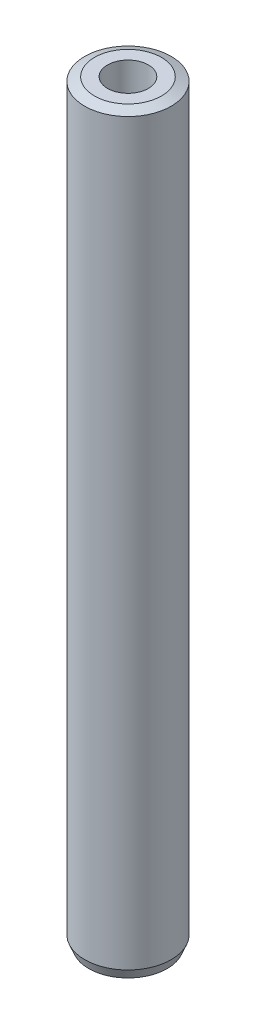
ISO-10303-21;
HEADER;
FILE_DESCRIPTION(('STEP AP214'),'2;1');
FILE_NAME('part.step','',(''),(''),'','','');
FILE_SCHEMA(('AUTOMOTIVE_DESIGN { 1 0 10303 214 1 1 1 1 }'));
ENDSEC;
DATA;
#1=APPLICATION_CONTEXT('core data for automotive mechanical design processes');
#2=APPLICATION_PROTOCOL_DEFINITION('international standard','automotive_design',2000,#1);
#3=PRODUCT_CONTEXT('',#1,'mechanical');
#4=PRODUCT('Part','Part','',(#3));
#5=PRODUCT_RELATED_PRODUCT_CATEGORY('part','',(#4));
#6=PRODUCT_DEFINITION_FORMATION('','',#4);
#7=PRODUCT_DEFINITION_CONTEXT('part definition',#1,'design');
#8=PRODUCT_DEFINITION('design','',#6,#7);
#9=PRODUCT_DEFINITION_SHAPE('','',#8);
#10=(LENGTH_UNIT() NAMED_UNIT(*) SI_UNIT(.MILLI.,.METRE.));
#11=(NAMED_UNIT(*) PLANE_ANGLE_UNIT() SI_UNIT($,.RADIAN.));
#12=(NAMED_UNIT(*) SI_UNIT($,.STERADIAN.) SOLID_ANGLE_UNIT());
#13=UNCERTAINTY_MEASURE_WITH_UNIT(LENGTH_MEASURE(1.E-05),#10,'distance_accuracy_value','');
#14=(GEOMETRIC_REPRESENTATION_CONTEXT(3) GLOBAL_UNCERTAINTY_ASSIGNED_CONTEXT((#13)) GLOBAL_UNIT_ASSIGNED_CONTEXT((#10,
#11,#12)) REPRESENTATION_CONTEXT('',''));
#15=CARTESIAN_POINT('',(0.,0.,0.));
#16=DIRECTION('',(0.,0.,1.));
#17=DIRECTION('',(1.,0.,0.));
#18=AXIS2_PLACEMENT_3D('',#15,#16,#17);
#19=CARTESIAN_POINT('',(0.,217.734931522635,0.));
#20=DIRECTION('',(0.,-1.,0.));
#21=DIRECTION('',(0.,0.,-1.));
#22=AXIS2_PLACEMENT_3D('',#19,#20,#21);
#23=CYLINDRICAL_SURFACE('',#22,12.5);
#24=CARTESIAN_POINT('',(0.,216.581271832505,0.));
#25=DIRECTION('',(0.,1.,0.));
#26=DIRECTION('',(0.,0.,1.));
#27=AXIS2_PLACEMENT_3D('',#24,#25,#26);
#28=CIRCLE('',#27,12.5);
#29=CARTESIAN_POINT('',(0.,216.581271832505,12.5));
#30=VERTEX_POINT('',#29);
#31=EDGE_CURVE('E50',#30,#30,#28,.F.);
#32=ORIENTED_EDGE('',*,*,#31,.T.);
#33=EDGE_LOOP('',(#32));
#34=FACE_BOUND('',#33,.T.);
#35=CARTESIAN_POINT('',(0.,2.81892588250574,0.));
#36=DIRECTION('',(0.,1.,0.));
#37=DIRECTION('',(0.,0.,1.));
#38=AXIS2_PLACEMENT_3D('',#35,#36,#37);
#39=CIRCLE('',#38,12.5);
#40=CARTESIAN_POINT('',(0.,2.81892588250574,12.5));
#41=VERTEX_POINT('',#40);
#42=EDGE_CURVE('E51',#41,#41,#39,.T.);
#43=ORIENTED_EDGE('',*,*,#42,.T.);
#44=EDGE_LOOP('',(#43));
#45=FACE_BOUND('',#44,.T.);
#46=ADVANCED_FACE('F39',(#34,#45),#23,.T.);
#47=CARTESIAN_POINT('',(0.,217.734931522635,0.));
#48=DIRECTION('',(0.,1.,0.));
#49=DIRECTION('',(0.,0.,1.));
#50=AXIS2_PLACEMENT_3D('',#47,#48,#49);
#51=PLANE('',#50);
#52=CARTESIAN_POINT('',(0.,217.734931522635,0.));
#53=DIRECTION('',(0.,1.,0.));
#54=DIRECTION('',(0.,0.,1.));
#55=AXIS2_PLACEMENT_3D('',#52,#53,#54);
#56=CIRCLE('',#55,9.68107411749422);
#57=CARTESIAN_POINT('',(0.,217.734931522635,9.68107411749422));
#58=VERTEX_POINT('',#57);
#59=EDGE_CURVE('E54',#58,#58,#56,.T.);
#60=ORIENTED_EDGE('',*,*,#59,.T.);
#61=EDGE_LOOP('',(#60));
#62=FACE_BOUND('',#61,.T.);
#63=CARTESIAN_POINT('',(0.,217.734931522635,0.));
#64=DIRECTION('',(0.,1.,0.));
#65=DIRECTION('',(0.,0.,1.));
#66=AXIS2_PLACEMENT_3D('',#63,#64,#65);
#67=CIRCLE('',#66,5.90365599291404);
#68=CARTESIAN_POINT('',(0.,217.734931522635,5.90365599291404));
#69=VERTEX_POINT('',#68);
#70=EDGE_CURVE('E58',#69,#69,#67,.T.);
#71=ORIENTED_EDGE('',*,*,#70,.F.);
#72=EDGE_LOOP('',(#71));
#73=FACE_BOUND('',#72,.T.);
#74=ADVANCED_FACE('F69',(#62,#73),#51,.T.);
#75=CARTESIAN_POINT('',(0.,0.,0.));
#76=DIRECTION('',(0.,1.,0.));
#77=DIRECTION('',(0.,0.,1.));
#78=AXIS2_PLACEMENT_3D('',#75,#76,#77);
#79=PLANE('',#78);
#80=CARTESIAN_POINT('',(0.,0.,0.));
#81=DIRECTION('',(0.,1.,0.));
#82=DIRECTION('',(0.,0.,1.));
#83=AXIS2_PLACEMENT_3D('',#80,#81,#82);
#84=CIRCLE('',#83,11.3463403098697);
#85=CARTESIAN_POINT('',(0.,0.,11.3463403098697));
#86=VERTEX_POINT('',#85);
#87=EDGE_CURVE('E10',#86,#86,#84,.F.);
#88=ORIENTED_EDGE('',*,*,#87,.T.);
#89=EDGE_LOOP('',(#88));
#90=FACE_BOUND('',#89,.T.);
#91=CARTESIAN_POINT('',(0.,0.,0.));
#92=DIRECTION('',(0.,1.,0.));
#93=DIRECTION('',(0.,0.,1.));
#94=AXIS2_PLACEMENT_3D('',#91,#92,#93);
#95=CIRCLE('',#94,5.90365599291404);
#96=CARTESIAN_POINT('',(0.,0.,5.90365599291404));
#97=VERTEX_POINT('',#96);
#98=EDGE_CURVE('E63',#97,#97,#95,.T.);
#99=ORIENTED_EDGE('',*,*,#98,.T.);
#100=EDGE_LOOP('',(#99));
#101=FACE_BOUND('',#100,.T.);
#102=ADVANCED_FACE('F75',(#90,#101),#79,.F.);
#103=CARTESIAN_POINT('',(0.,217.734931522635,0.));
#104=DIRECTION('',(0.,-1.,0.));
#105=DIRECTION('',(0.,0.,-1.));
#106=AXIS2_PLACEMENT_3D('',#103,#104,#105);
#107=CYLINDRICAL_SURFACE('',#106,5.90365599291404);
#108=ORIENTED_EDGE('',*,*,#70,.T.);
#109=EDGE_LOOP('',(#108));
#110=FACE_BOUND('',#109,.T.);
#111=ORIENTED_EDGE('',*,*,#98,.F.);
#112=EDGE_LOOP('',(#111));
#113=FACE_BOUND('',#112,.T.);
#114=ADVANCED_FACE('F70',(#110,#113),#107,.F.);
#115=CARTESIAN_POINT('',(0.,217.734931522635,0.));
#116=DIRECTION('',(0.,-1.,0.));
#117=DIRECTION('',(0.,0.,-1.));
#118=AXIS2_PLACEMENT_3D('',#115,#116,#117);
#119=CONICAL_SURFACE('',#118,9.68107411749422,1.18233699622266);
#120=ORIENTED_EDGE('',*,*,#31,.F.);
#121=EDGE_LOOP('',(#120));
#122=FACE_BOUND('',#121,.T.);
#123=ORIENTED_EDGE('',*,*,#59,.F.);
#124=EDGE_LOOP('',(#123));
#125=FACE_BOUND('',#124,.T.);
#126=ADVANCED_FACE('F81',(#122,#125),#119,.T.);
#127=CARTESIAN_POINT('',(0.,2.81892588250574,0.));
#128=DIRECTION('',(0.,1.,0.));
#129=DIRECTION('',(0.,0.,1.));
#130=AXIS2_PLACEMENT_3D('',#127,#128,#129);
#131=CONICAL_SURFACE('',#130,12.5,0.38845933057225);
#132=ORIENTED_EDGE('',*,*,#87,.F.);
#133=EDGE_LOOP('',(#132));
#134=FACE_BOUND('',#133,.T.);
#135=ORIENTED_EDGE('',*,*,#42,.F.);
#136=EDGE_LOOP('',(#135));
#137=FACE_BOUND('',#136,.T.);
#138=ADVANCED_FACE('F45',(#134,#137),#131,.T.);
#139=CLOSED_SHELL('',(#46,#74,#102,#114,#126,#138));
#140=MANIFOLD_SOLID_BREP('B2',#139);
#141=ADVANCED_BREP_SHAPE_REPRESENTATION('',(#18,#140),#14);
#142=SHAPE_DEFINITION_REPRESENTATION(#9,#141);
ENDSEC;
END-ISO-10303-21;
